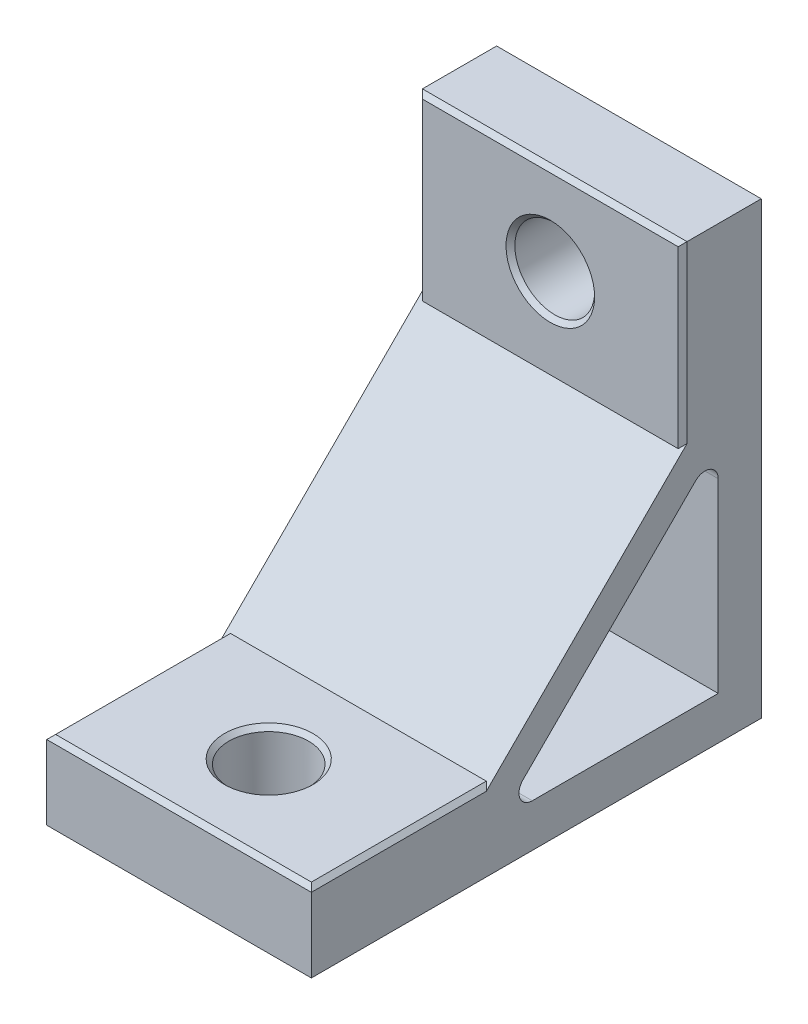
ISO-10303-21;
HEADER;
FILE_DESCRIPTION(('STEP AP214'),'2;1');
FILE_NAME('part.step','',(''),(''),'','','');
FILE_SCHEMA(('AUTOMOTIVE_DESIGN { 1 0 10303 214 1 1 1 1 }'));
ENDSEC;
DATA;
#1=APPLICATION_CONTEXT('core data for automotive mechanical design processes');
#2=APPLICATION_PROTOCOL_DEFINITION('international standard','automotive_design',2000,#1);
#3=PRODUCT_CONTEXT('',#1,'mechanical');
#4=PRODUCT('Part','Part','',(#3));
#5=PRODUCT_RELATED_PRODUCT_CATEGORY('part','',(#4));
#6=PRODUCT_DEFINITION_FORMATION('','',#4);
#7=PRODUCT_DEFINITION_CONTEXT('part definition',#1,'design');
#8=PRODUCT_DEFINITION('design','',#6,#7);
#9=PRODUCT_DEFINITION_SHAPE('','',#8);
#10=(LENGTH_UNIT() NAMED_UNIT(*) SI_UNIT(.MILLI.,.METRE.));
#11=(NAMED_UNIT(*) PLANE_ANGLE_UNIT() SI_UNIT($,.RADIAN.));
#12=(NAMED_UNIT(*) SI_UNIT($,.STERADIAN.) SOLID_ANGLE_UNIT());
#13=UNCERTAINTY_MEASURE_WITH_UNIT(LENGTH_MEASURE(1.E-05),#10,'distance_accuracy_value','');
#14=(GEOMETRIC_REPRESENTATION_CONTEXT(3) GLOBAL_UNCERTAINTY_ASSIGNED_CONTEXT((#13)) GLOBAL_UNIT_ASSIGNED_CONTEXT((#10,
#11,#12)) REPRESENTATION_CONTEXT('',''));
#15=CARTESIAN_POINT('',(0.,0.,0.));
#16=DIRECTION('',(0.,0.,1.));
#17=DIRECTION('',(1.,0.,0.));
#18=AXIS2_PLACEMENT_3D('',#15,#16,#17);
#19=CARTESIAN_POINT('',(14.94,0.,0.));
#20=DIRECTION('',(1.,0.,0.));
#21=DIRECTION('',(0.,0.,-1.));
#22=AXIS2_PLACEMENT_3D('',#19,#20,#21);
#23=PLANE('',#22);
#24=DIRECTION('',(0.,-0.707106781186552,0.707106781186543));
#25=VECTOR('',#24,1.);
#26=CARTESIAN_POINT('',(14.94,21.67,0.));
#27=LINE('',#26,#25);
#28=CARTESIAN_POINT('',(14.94,22.17,-0.499999999999994));
#29=VERTEX_POINT('',#28);
#30=CARTESIAN_POINT('',(14.94,-0.500000000000004,22.1699999999997));
#31=VERTEX_POINT('',#30);
#32=EDGE_CURVE('E195',#29,#31,#27,.T.);
#33=ORIENTED_EDGE('',*,*,#32,.T.);
#34=DIRECTION('',(0.,0.,1.));
#35=VECTOR('',#34,1.);
#36=CARTESIAN_POINT('',(14.94,-0.5,41.92));
#37=LINE('',#36,#35);
#38=CARTESIAN_POINT('',(14.94,-0.5,41.92));
#39=VERTEX_POINT('',#38);
#40=EDGE_CURVE('E249',#31,#39,#37,.T.);
#41=ORIENTED_EDGE('',*,*,#40,.T.);
#42=DIRECTION('',(0.,-1.,0.));
#43=VECTOR('',#42,1.);
#44=CARTESIAN_POINT('',(14.94,0.,41.92));
#45=LINE('',#44,#43);
#46=CARTESIAN_POINT('',(14.94,-8.88000000000001,41.92));
#47=VERTEX_POINT('',#46);
#48=EDGE_CURVE('E185',#39,#47,#45,.T.);
#49=ORIENTED_EDGE('',*,*,#48,.T.);
#50=DIRECTION('',(0.,0.,-1.));
#51=VECTOR('',#50,1.);
#52=CARTESIAN_POINT('',(14.94,-8.88000000000001,41.92));
#53=LINE('',#52,#51);
#54=CARTESIAN_POINT('',(14.94,-8.88,-8.88));
#55=VERTEX_POINT('',#54);
#56=EDGE_CURVE('E187',#47,#55,#53,.T.);
#57=ORIENTED_EDGE('',*,*,#56,.T.);
#58=DIRECTION('',(0.,1.,0.));
#59=VECTOR('',#58,1.);
#60=CARTESIAN_POINT('',(14.94,-8.88,-8.88));
#61=LINE('',#60,#59);
#62=CARTESIAN_POINT('',(14.94,41.92,-8.88));
#63=VERTEX_POINT('',#62);
#64=EDGE_CURVE('E190',#55,#63,#61,.T.);
#65=ORIENTED_EDGE('',*,*,#64,.T.);
#66=DIRECTION('',(0.,0.,1.));
#67=VECTOR('',#66,1.);
#68=CARTESIAN_POINT('',(14.94,41.92,-8.88));
#69=LINE('',#68,#67);
#70=CARTESIAN_POINT('',(14.94,41.92,-0.499999999999994));
#71=VERTEX_POINT('',#70);
#72=EDGE_CURVE('E192',#63,#71,#69,.T.);
#73=ORIENTED_EDGE('',*,*,#72,.T.);
#74=DIRECTION('',(0.,-1.,0.));
#75=VECTOR('',#74,1.);
#76=CARTESIAN_POINT('',(14.94,21.67,-0.499999999999993));
#77=LINE('',#76,#75);
#78=EDGE_CURVE('E246',#71,#29,#77,.T.);
#79=ORIENTED_EDGE('',*,*,#78,.T.);
#80=EDGE_LOOP('',(#33,#41,#49,#57,#65,#73,#79));
#81=FACE_BOUND('',#80,.T.);
#82=DIRECTION('',(0.,0.,-1.));
#83=VECTOR('',#82,1.);
#84=CARTESIAN_POINT('',(14.94,-4.01999999999994,0.));
#85=LINE('',#84,#83);
#86=CARTESIAN_POINT('',(14.94,-4.01999999999984,16.9775108318969));
#87=VERTEX_POINT('',#86);
#88=CARTESIAN_POINT('',(14.94,-4.01999999999997,-4.02));
#89=VERTEX_POINT('',#88);
#90=EDGE_CURVE('E155',#87,#89,#85,.T.);
#91=ORIENTED_EDGE('',*,*,#90,.F.);
#92=CARTESIAN_POINT('',(14.94,-2.51999999999984,16.9775108318968));
#93=DIRECTION('',(1.,0.,0.));
#94=DIRECTION('',(0.,0.,-1.));
#95=AXIS2_PLACEMENT_3D('',#92,#93,#94);
#96=CIRCLE('',#95,1.5);
#97=CARTESIAN_POINT('',(14.94,-1.45933982822002,18.0381710036767));
#98=VERTEX_POINT('',#97);
#99=EDGE_CURVE('E227',#87,#98,#96,.F.);
#100=ORIENTED_EDGE('',*,*,#99,.T.);
#101=DIRECTION('',(0.,0.707106781186545,-0.70710678118655));
#102=VECTOR('',#101,1.);
#103=CARTESIAN_POINT('',(14.94,8.28941558772832,8.28941558772827));
#104=LINE('',#103,#102);
#105=CARTESIAN_POINT('',(14.94,18.0381710036767,-1.45933982822018));
#106=VERTEX_POINT('',#105);
#107=EDGE_CURVE('E171',#98,#106,#104,.T.);
#108=ORIENTED_EDGE('',*,*,#107,.T.);
#109=CARTESIAN_POINT('',(14.94,16.9775108318969,-2.52));
#110=DIRECTION('',(1.,0.,0.));
#111=DIRECTION('',(0.,0.,-1.));
#112=AXIS2_PLACEMENT_3D('',#109,#110,#111);
#113=CIRCLE('',#112,1.5);
#114=CARTESIAN_POINT('',(14.94,16.9775108318969,-4.02));
#115=VERTEX_POINT('',#114);
#116=EDGE_CURVE('E157',#106,#115,#113,.F.);
#117=ORIENTED_EDGE('',*,*,#116,.T.);
#118=DIRECTION('',(0.,-1.,0.));
#119=VECTOR('',#118,1.);
#120=CARTESIAN_POINT('',(14.94,0.,-4.02));
#121=LINE('',#120,#119);
#122=EDGE_CURVE('E153',#115,#89,#121,.T.);
#123=ORIENTED_EDGE('',*,*,#122,.T.);
#124=EDGE_LOOP('',(#91,#100,#108,#117,#123));
#125=FACE_BOUND('',#124,.T.);
#126=ADVANCED_FACE('F37',(#81,#125),#23,.T.);
#127=CARTESIAN_POINT('',(-14.94,0.,0.));
#128=DIRECTION('',(1.,0.,0.));
#129=DIRECTION('',(0.,0.,-1.));
#130=AXIS2_PLACEMENT_3D('',#127,#128,#129);
#131=PLANE('',#130);
#132=DIRECTION('',(0.,-1.,0.));
#133=VECTOR('',#132,1.);
#134=CARTESIAN_POINT('',(-14.94,0.,41.92));
#135=LINE('',#134,#133);
#136=CARTESIAN_POINT('',(-14.94,-0.5,41.92));
#137=VERTEX_POINT('',#136);
#138=CARTESIAN_POINT('',(-14.94,-8.88000000000001,41.92));
#139=VERTEX_POINT('',#138);
#140=EDGE_CURVE('E177',#137,#139,#135,.T.);
#141=ORIENTED_EDGE('',*,*,#140,.F.);
#142=DIRECTION('',(0.,0.,-1.));
#143=VECTOR('',#142,1.);
#144=CARTESIAN_POINT('',(-14.94,-0.500000000000007,0.));
#145=LINE('',#144,#143);
#146=CARTESIAN_POINT('',(-14.94,-0.500000000000004,22.1699999999997));
#147=VERTEX_POINT('',#146);
#148=EDGE_CURVE('E256',#137,#147,#145,.T.);
#149=ORIENTED_EDGE('',*,*,#148,.T.);
#150=DIRECTION('',(0.,-0.707106781186552,0.707106781186543));
#151=VECTOR('',#150,1.);
#152=CARTESIAN_POINT('',(-14.94,21.67,0.));
#153=LINE('',#152,#151);
#154=CARTESIAN_POINT('',(-14.94,22.17,-0.499999999999993));
#155=VERTEX_POINT('',#154);
#156=EDGE_CURVE('E188',#155,#147,#153,.T.);
#157=ORIENTED_EDGE('',*,*,#156,.F.);
#158=DIRECTION('',(0.,1.,0.));
#159=VECTOR('',#158,1.);
#160=CARTESIAN_POINT('',(-14.94,0.,-0.499999999999993));
#161=LINE('',#160,#159);
#162=CARTESIAN_POINT('',(-14.94,41.92,-0.499999999999995));
#163=VERTEX_POINT('',#162);
#164=EDGE_CURVE('E254',#155,#163,#161,.T.);
#165=ORIENTED_EDGE('',*,*,#164,.T.);
#166=DIRECTION('',(0.,0.,1.));
#167=VECTOR('',#166,1.);
#168=CARTESIAN_POINT('',(-14.94,41.92,-8.88));
#169=LINE('',#168,#167);
#170=CARTESIAN_POINT('',(-14.94,41.92,-8.88));
#171=VERTEX_POINT('',#170);
#172=EDGE_CURVE('E201',#171,#163,#169,.T.);
#173=ORIENTED_EDGE('',*,*,#172,.F.);
#174=DIRECTION('',(0.,1.,0.));
#175=VECTOR('',#174,1.);
#176=CARTESIAN_POINT('',(-14.94,-8.88,-8.88));
#177=LINE('',#176,#175);
#178=CARTESIAN_POINT('',(-14.94,-8.88,-8.88));
#179=VERTEX_POINT('',#178);
#180=EDGE_CURVE('E199',#179,#171,#177,.T.);
#181=ORIENTED_EDGE('',*,*,#180,.F.);
#182=DIRECTION('',(0.,0.,-1.));
#183=VECTOR('',#182,1.);
#184=CARTESIAN_POINT('',(-14.94,-8.88000000000001,41.92));
#185=LINE('',#184,#183);
#186=EDGE_CURVE('E179',#139,#179,#185,.T.);
#187=ORIENTED_EDGE('',*,*,#186,.F.);
#188=EDGE_LOOP('',(#141,#149,#157,#165,#173,#181,#187));
#189=FACE_BOUND('',#188,.T.);
#190=DIRECTION('',(0.,0.707106781186545,-0.70710678118655));
#191=VECTOR('',#190,1.);
#192=CARTESIAN_POINT('',(-14.94,8.28941558772832,8.28941558772827));
#193=LINE('',#192,#191);
#194=CARTESIAN_POINT('',(-14.94,-1.45933982822002,18.0381710036767));
#195=VERTEX_POINT('',#194);
#196=CARTESIAN_POINT('',(-14.94,18.0381710036767,-1.45933982822018));
#197=VERTEX_POINT('',#196);
#198=EDGE_CURVE('E161',#195,#197,#193,.T.);
#199=ORIENTED_EDGE('',*,*,#198,.F.);
#200=CARTESIAN_POINT('',(-14.94,-2.51999999999984,16.9775108318968));
#201=DIRECTION('',(1.,0.,0.));
#202=DIRECTION('',(0.,0.,-1.));
#203=AXIS2_PLACEMENT_3D('',#200,#201,#202);
#204=CIRCLE('',#203,1.5);
#205=CARTESIAN_POINT('',(-14.94,-4.01999999999984,16.9775108318969));
#206=VERTEX_POINT('',#205);
#207=EDGE_CURVE('E229',#195,#206,#204,.T.);
#208=ORIENTED_EDGE('',*,*,#207,.T.);
#209=DIRECTION('',(0.,0.,-1.));
#210=VECTOR('',#209,1.);
#211=CARTESIAN_POINT('',(-14.94,-4.01999999999994,0.));
#212=LINE('',#211,#210);
#213=CARTESIAN_POINT('',(-14.94,-4.01999999999997,-4.02));
#214=VERTEX_POINT('',#213);
#215=EDGE_CURVE('E181',#206,#214,#212,.T.);
#216=ORIENTED_EDGE('',*,*,#215,.T.);
#217=DIRECTION('',(0.,-1.,0.));
#218=VECTOR('',#217,1.);
#219=CARTESIAN_POINT('',(-14.94,0.,-4.02));
#220=LINE('',#219,#218);
#221=CARTESIAN_POINT('',(-14.94,16.9775108318969,-4.02));
#222=VERTEX_POINT('',#221);
#223=EDGE_CURVE('E175',#222,#214,#220,.T.);
#224=ORIENTED_EDGE('',*,*,#223,.F.);
#225=CARTESIAN_POINT('',(-14.94,16.9775108318969,-2.52));
#226=DIRECTION('',(1.,0.,0.));
#227=DIRECTION('',(0.,0.,-1.));
#228=AXIS2_PLACEMENT_3D('',#225,#226,#227);
#229=CIRCLE('',#228,1.5);
#230=EDGE_CURVE('E232',#222,#197,#229,.T.);
#231=ORIENTED_EDGE('',*,*,#230,.T.);
#232=EDGE_LOOP('',(#199,#208,#216,#224,#231));
#233=FACE_BOUND('',#232,.T.);
#234=ADVANCED_FACE('F305',(#189,#233),#131,.F.);
#235=CARTESIAN_POINT('',(14.94,0.,41.92));
#236=DIRECTION('',(0.,0.,-1.));
#237=DIRECTION('',(-1.,0.,0.));
#238=AXIS2_PLACEMENT_3D('',#235,#236,#237);
#239=PLANE('',#238);
#240=ORIENTED_EDGE('',*,*,#48,.F.);
#241=DIRECTION('',(-1.,0.,0.));
#242=VECTOR('',#241,1.);
#243=CARTESIAN_POINT('',(14.94,-0.5,41.92));
#244=LINE('',#243,#242);
#245=EDGE_CURVE('E252',#39,#137,#244,.T.);
#246=ORIENTED_EDGE('',*,*,#245,.T.);
#247=ORIENTED_EDGE('',*,*,#140,.T.);
#248=DIRECTION('',(-1.,0.,0.));
#249=VECTOR('',#248,1.);
#250=CARTESIAN_POINT('',(14.94,-8.88000000000001,41.92));
#251=LINE('',#250,#249);
#252=EDGE_CURVE('E216',#47,#139,#251,.T.);
#253=ORIENTED_EDGE('',*,*,#252,.F.);
#254=EDGE_LOOP('',(#240,#246,#247,#253));
#255=FACE_BOUND('',#254,.T.);
#256=ADVANCED_FACE('F324',(#255),#239,.F.);
#257=CARTESIAN_POINT('',(14.94,-8.88000000000001,41.92));
#258=DIRECTION('',(0.,1.,0.));
#259=DIRECTION('',(0.,0.,1.));
#260=AXIS2_PLACEMENT_3D('',#257,#258,#259);
#261=PLANE('',#260);
#262=CARTESIAN_POINT('',(0.,-8.88000000000001,31.7949999999999));
#263=DIRECTION('',(0.,1.,0.));
#264=DIRECTION('',(0.,0.,1.));
#265=AXIS2_PLACEMENT_3D('',#262,#263,#264);
#266=CIRCLE('',#265,4.5);
#267=CARTESIAN_POINT('',(0.,-8.88000000000001,36.2949999999999));
#268=VERTEX_POINT('',#267);
#269=EDGE_CURVE('E376',#268,#268,#266,.T.);
#270=ORIENTED_EDGE('',*,*,#269,.T.);
#271=EDGE_LOOP('',(#270));
#272=FACE_BOUND('',#271,.T.);
#273=ORIENTED_EDGE('',*,*,#186,.T.);
#274=DIRECTION('',(-1.,0.,0.));
#275=VECTOR('',#274,1.);
#276=CARTESIAN_POINT('',(14.94,-8.88,-8.88));
#277=LINE('',#276,#275);
#278=EDGE_CURVE('E213',#55,#179,#277,.T.);
#279=ORIENTED_EDGE('',*,*,#278,.F.);
#280=ORIENTED_EDGE('',*,*,#56,.F.);
#281=ORIENTED_EDGE('',*,*,#252,.T.);
#282=EDGE_LOOP('',(#273,#279,#280,#281));
#283=FACE_BOUND('',#282,.T.);
#284=ADVANCED_FACE('F326',(#272,#283),#261,.F.);
#285=CARTESIAN_POINT('',(14.94,-8.88,-8.88));
#286=DIRECTION('',(0.,0.,1.));
#287=DIRECTION('',(1.,0.,0.));
#288=AXIS2_PLACEMENT_3D('',#285,#286,#287);
#289=PLANE('',#288);
#290=CARTESIAN_POINT('',(0.,31.795,-8.88));
#291=DIRECTION('',(0.,0.,1.));
#292=DIRECTION('',(1.,0.,0.));
#293=AXIS2_PLACEMENT_3D('',#290,#291,#292);
#294=CIRCLE('',#293,4.5);
#295=CARTESIAN_POINT('',(4.5,31.795,-8.88));
#296=VERTEX_POINT('',#295);
#297=EDGE_CURVE('E282',#296,#296,#294,.T.);
#298=ORIENTED_EDGE('',*,*,#297,.T.);
#299=EDGE_LOOP('',(#298));
#300=FACE_BOUND('',#299,.T.);
#301=ORIENTED_EDGE('',*,*,#180,.T.);
#302=DIRECTION('',(-1.,0.,0.));
#303=VECTOR('',#302,1.);
#304=CARTESIAN_POINT('',(14.94,41.92,-8.88));
#305=LINE('',#304,#303);
#306=EDGE_CURVE('E210',#63,#171,#305,.T.);
#307=ORIENTED_EDGE('',*,*,#306,.F.);
#308=ORIENTED_EDGE('',*,*,#64,.F.);
#309=ORIENTED_EDGE('',*,*,#278,.T.);
#310=EDGE_LOOP('',(#301,#307,#308,#309));
#311=FACE_BOUND('',#310,.T.);
#312=ADVANCED_FACE('F329',(#300,#311),#289,.F.);
#313=CARTESIAN_POINT('',(14.94,41.92,-8.88));
#314=DIRECTION('',(0.,-1.,0.));
#315=DIRECTION('',(0.,0.,-1.));
#316=AXIS2_PLACEMENT_3D('',#313,#314,#315);
#317=PLANE('',#316);
#318=ORIENTED_EDGE('',*,*,#172,.T.);
#319=DIRECTION('',(1.,0.,0.));
#320=VECTOR('',#319,1.);
#321=CARTESIAN_POINT('',(14.94,41.92,-0.499999999999995));
#322=LINE('',#321,#320);
#323=EDGE_CURVE('E269',#163,#71,#322,.T.);
#324=ORIENTED_EDGE('',*,*,#323,.T.);
#325=ORIENTED_EDGE('',*,*,#72,.F.);
#326=ORIENTED_EDGE('',*,*,#306,.T.);
#327=EDGE_LOOP('',(#318,#324,#325,#326));
#328=FACE_BOUND('',#327,.T.);
#329=ADVANCED_FACE('F300',(#328),#317,.F.);
#330=CARTESIAN_POINT('',(14.94,41.92,0.));
#331=DIRECTION('',(0.,0.,-1.));
#332=DIRECTION('',(0.,1.,0.));
#333=AXIS2_PLACEMENT_3D('',#330,#331,#332);
#334=PLANE('',#333);
#335=CARTESIAN_POINT('',(0.,31.795,0.));
#336=DIRECTION('',(0.,0.,-1.));
#337=DIRECTION('',(0.,1.,0.));
#338=AXIS2_PLACEMENT_3D('',#335,#336,#337);
#339=CIRCLE('',#338,4.99999999999999);
#340=CARTESIAN_POINT('',(0.,36.795,0.));
#341=VERTEX_POINT('',#340);
#342=EDGE_CURVE('E266',#341,#341,#339,.T.);
#343=ORIENTED_EDGE('',*,*,#342,.T.);
#344=EDGE_LOOP('',(#343));
#345=FACE_BOUND('',#344,.T.);
#346=DIRECTION('',(-1.,0.,0.));
#347=VECTOR('',#346,1.);
#348=CARTESIAN_POINT('',(14.94,41.42,0.));
#349=LINE('',#348,#347);
#350=CARTESIAN_POINT('',(14.44,41.42,0.));
#351=VERTEX_POINT('',#350);
#352=CARTESIAN_POINT('',(-14.44,41.42,0.));
#353=VERTEX_POINT('',#352);
#354=EDGE_CURVE('E55',#351,#353,#349,.T.);
#355=ORIENTED_EDGE('',*,*,#354,.T.);
#356=DIRECTION('',(0.,-1.,0.));
#357=VECTOR('',#356,1.);
#358=CARTESIAN_POINT('',(-14.44,41.92,0.));
#359=LINE('',#358,#357);
#360=CARTESIAN_POINT('',(-14.44,21.67,0.));
#361=VERTEX_POINT('',#360);
#362=EDGE_CURVE('E264',#353,#361,#359,.T.);
#363=ORIENTED_EDGE('',*,*,#362,.T.);
#364=DIRECTION('',(-1.,0.,0.));
#365=VECTOR('',#364,1.);
#366=CARTESIAN_POINT('',(14.94,21.67,0.));
#367=LINE('',#366,#365);
#368=CARTESIAN_POINT('',(14.44,21.67,0.));
#369=VERTEX_POINT('',#368);
#370=EDGE_CURVE('E207',#369,#361,#367,.T.);
#371=ORIENTED_EDGE('',*,*,#370,.F.);
#372=DIRECTION('',(0.,1.,0.));
#373=VECTOR('',#372,1.);
#374=CARTESIAN_POINT('',(14.44,41.92,0.));
#375=LINE('',#374,#373);
#376=EDGE_CURVE('E60',#369,#351,#375,.T.);
#377=ORIENTED_EDGE('',*,*,#376,.T.);
#378=EDGE_LOOP('',(#355,#363,#371,#377));
#379=FACE_BOUND('',#378,.T.);
#380=ADVANCED_FACE('F310',(#345,#379),#334,.F.);
#381=CARTESIAN_POINT('',(14.94,21.67,0.));
#382=DIRECTION('',(0.,-0.707106781186543,-0.707106781186552));
#383=DIRECTION('',(0.,0.707106781186552,-0.707106781186543));
#384=AXIS2_PLACEMENT_3D('',#381,#382,#383);
#385=PLANE('',#384);
#386=ORIENTED_EDGE('',*,*,#156,.T.);
#387=DIRECTION('',(-0.577350269189623,-0.577350269189631,0.577350269189624));
#388=VECTOR('',#387,1.);
#389=CARTESIAN_POINT('',(9.79999999999978,24.2400000000001,-2.57000000000008));
#390=LINE('',#389,#388);
#391=CARTESIAN_POINT('',(-14.44,0.,21.6699999999997));
#392=VERTEX_POINT('',#391);
#393=EDGE_CURVE('E274',#147,#392,#390,.F.);
#394=ORIENTED_EDGE('',*,*,#393,.T.);
#395=DIRECTION('',(-1.,0.,0.));
#396=VECTOR('',#395,1.);
#397=CARTESIAN_POINT('',(14.94,0.,21.6699999999997));
#398=LINE('',#397,#396);
#399=CARTESIAN_POINT('',(14.44,0.,21.6699999999997));
#400=VERTEX_POINT('',#399);
#401=EDGE_CURVE('E196',#400,#392,#398,.T.);
#402=ORIENTED_EDGE('',*,*,#401,.F.);
#403=DIRECTION('',(0.577350269189623,-0.577350269189631,0.577350269189624));
#404=VECTOR('',#403,1.);
#405=CARTESIAN_POINT('',(0.16000000000012,14.2800000000001,7.38999999999984));
#406=LINE('',#405,#404);
#407=EDGE_CURVE('E271',#400,#31,#406,.T.);
#408=ORIENTED_EDGE('',*,*,#407,.T.);
#409=ORIENTED_EDGE('',*,*,#32,.F.);
#410=DIRECTION('',(-0.577350269189629,-0.577350269189627,0.577350269189621));
#411=VECTOR('',#410,1.);
#412=CARTESIAN_POINT('',(14.6066666666667,21.8366666666667,-0.166666666666666));
#413=LINE('',#412,#411);
#414=EDGE_CURVE('E11',#29,#369,#413,.T.);
#415=ORIENTED_EDGE('',*,*,#414,.T.);
#416=ORIENTED_EDGE('',*,*,#370,.T.);
#417=DIRECTION('',(0.577350269189629,-0.577350269189627,0.577350269189621));
#418=VECTOR('',#417,1.);
#419=CARTESIAN_POINT('',(-4.64666666666655,11.8766666666666,9.7933333333333));
#420=LINE('',#419,#418);
#421=EDGE_CURVE('E47',#361,#155,#420,.F.);
#422=ORIENTED_EDGE('',*,*,#421,.T.);
#423=EDGE_LOOP('',(#386,#394,#402,#408,#409,#415,#416,#422));
#424=FACE_BOUND('',#423,.T.);
#425=ADVANCED_FACE('F311',(#424),#385,.F.);
#426=CARTESIAN_POINT('',(14.94,0.,21.6699999999997));
#427=DIRECTION('',(0.,-1.,0.));
#428=DIRECTION('',(0.,0.,-1.));
#429=AXIS2_PLACEMENT_3D('',#426,#427,#428);
#430=PLANE('',#429);
#431=CARTESIAN_POINT('',(0.,0.,31.7949999999999));
#432=DIRECTION('',(0.,-1.,0.));
#433=DIRECTION('',(0.,0.,-1.));
#434=AXIS2_PLACEMENT_3D('',#431,#432,#433);
#435=CIRCLE('',#434,4.99999999999999);
#436=CARTESIAN_POINT('',(0.,0.,26.7949999999999));
#437=VERTEX_POINT('',#436);
#438=EDGE_CURVE('E243',#437,#437,#435,.T.);
#439=ORIENTED_EDGE('',*,*,#438,.T.);
#440=EDGE_LOOP('',(#439));
#441=FACE_BOUND('',#440,.T.);
#442=DIRECTION('',(1.,0.,0.));
#443=VECTOR('',#442,1.);
#444=CARTESIAN_POINT('',(14.94,0.,41.42));
#445=LINE('',#444,#443);
#446=CARTESIAN_POINT('',(-14.44,0.,41.42));
#447=VERTEX_POINT('',#446);
#448=CARTESIAN_POINT('',(14.44,0.,41.42));
#449=VERTEX_POINT('',#448);
#450=EDGE_CURVE('E239',#447,#449,#445,.T.);
#451=ORIENTED_EDGE('',*,*,#450,.T.);
#452=DIRECTION('',(0.,0.,-1.));
#453=VECTOR('',#452,1.);
#454=CARTESIAN_POINT('',(14.44,0.,21.6699999999997));
#455=LINE('',#454,#453);
#456=EDGE_CURVE('E241',#449,#400,#455,.T.);
#457=ORIENTED_EDGE('',*,*,#456,.T.);
#458=ORIENTED_EDGE('',*,*,#401,.T.);
#459=DIRECTION('',(0.,0.,1.));
#460=VECTOR('',#459,1.);
#461=CARTESIAN_POINT('',(-14.44,0.,21.6699999999997));
#462=LINE('',#461,#460);
#463=EDGE_CURVE('E237',#392,#447,#462,.T.);
#464=ORIENTED_EDGE('',*,*,#463,.T.);
#465=EDGE_LOOP('',(#451,#457,#458,#464));
#466=FACE_BOUND('',#465,.T.);
#467=ADVANCED_FACE('F351',(#441,#466),#430,.F.);
#468=CARTESIAN_POINT('',(-14.94,8.28941558772832,8.28941558772827));
#469=DIRECTION('',(0.,-0.70710678118655,-0.707106781186545));
#470=DIRECTION('',(0.,0.707106781186545,-0.70710678118655));
#471=AXIS2_PLACEMENT_3D('',#468,#469,#470);
#472=PLANE('',#471);
#473=ORIENTED_EDGE('',*,*,#107,.F.);
#474=DIRECTION('',(1.,0.,0.));
#475=VECTOR('',#474,1.);
#476=CARTESIAN_POINT('',(-14.94,-1.45933982822002,18.0381710036767));
#477=LINE('',#476,#475);
#478=EDGE_CURVE('E223',#98,#195,#477,.F.);
#479=ORIENTED_EDGE('',*,*,#478,.T.);
#480=ORIENTED_EDGE('',*,*,#198,.T.);
#481=DIRECTION('',(1.,0.,0.));
#482=VECTOR('',#481,1.);
#483=CARTESIAN_POINT('',(14.94,18.0381710036767,-1.45933982822018));
#484=LINE('',#483,#482);
#485=EDGE_CURVE('E220',#197,#106,#484,.T.);
#486=ORIENTED_EDGE('',*,*,#485,.T.);
#487=EDGE_LOOP('',(#473,#479,#480,#486));
#488=FACE_BOUND('',#487,.T.);
#489=ADVANCED_FACE('F348',(#488),#472,.T.);
#490=CARTESIAN_POINT('',(-14.94,0.,-4.02));
#491=DIRECTION('',(0.,0.,1.));
#492=DIRECTION('',(0.,-1.,0.));
#493=AXIS2_PLACEMENT_3D('',#490,#491,#492);
#494=PLANE('',#493);
#495=ORIENTED_EDGE('',*,*,#122,.F.);
#496=DIRECTION('',(1.,0.,0.));
#497=VECTOR('',#496,1.);
#498=CARTESIAN_POINT('',(-14.94,16.9775108318969,-4.02));
#499=LINE('',#498,#497);
#500=EDGE_CURVE('E225',#115,#222,#499,.F.);
#501=ORIENTED_EDGE('',*,*,#500,.T.);
#502=ORIENTED_EDGE('',*,*,#223,.T.);
#503=DIRECTION('',(1.,0.,0.));
#504=VECTOR('',#503,1.);
#505=CARTESIAN_POINT('',(-14.94,-4.01999999999997,-4.02));
#506=LINE('',#505,#504);
#507=EDGE_CURVE('E168',#214,#89,#506,.T.);
#508=ORIENTED_EDGE('',*,*,#507,.T.);
#509=EDGE_LOOP('',(#495,#501,#502,#508));
#510=FACE_BOUND('',#509,.T.);
#511=ADVANCED_FACE('F173',(#510),#494,.T.);
#512=CARTESIAN_POINT('',(-14.94,-4.01999999999994,0.));
#513=DIRECTION('',(0.,-1.,0.));
#514=DIRECTION('',(0.,0.,-1.));
#515=AXIS2_PLACEMENT_3D('',#512,#513,#514);
#516=PLANE('',#515);
#517=ORIENTED_EDGE('',*,*,#215,.F.);
#518=DIRECTION('',(1.,0.,0.));
#519=VECTOR('',#518,1.);
#520=CARTESIAN_POINT('',(-14.94,-4.01999999999984,16.9775108318969));
#521=LINE('',#520,#519);
#522=EDGE_CURVE('E170',#206,#87,#521,.T.);
#523=ORIENTED_EDGE('',*,*,#522,.T.);
#524=ORIENTED_EDGE('',*,*,#90,.T.);
#525=ORIENTED_EDGE('',*,*,#507,.F.);
#526=EDGE_LOOP('',(#517,#523,#524,#525));
#527=FACE_BOUND('',#526,.T.);
#528=ADVANCED_FACE('F167',(#527),#516,.F.);
#529=CARTESIAN_POINT('',(-14.94,-2.51999999999984,16.9775108318968));
#530=DIRECTION('',(1.,0.,0.));
#531=DIRECTION('',(0.,0.,-1.));
#532=AXIS2_PLACEMENT_3D('',#529,#530,#531);
#533=CYLINDRICAL_SURFACE('',#532,1.5);
#534=ORIENTED_EDGE('',*,*,#207,.F.);
#535=ORIENTED_EDGE('',*,*,#478,.F.);
#536=ORIENTED_EDGE('',*,*,#99,.F.);
#537=ORIENTED_EDGE('',*,*,#522,.F.);
#538=EDGE_LOOP('',(#534,#535,#536,#537));
#539=FACE_BOUND('',#538,.T.);
#540=ADVANCED_FACE('F387',(#539),#533,.F.);
#541=CARTESIAN_POINT('',(-14.94,16.9775108318969,-2.52));
#542=DIRECTION('',(-1.,0.,0.));
#543=DIRECTION('',(0.,0.,1.));
#544=AXIS2_PLACEMENT_3D('',#541,#542,#543);
#545=CYLINDRICAL_SURFACE('',#544,1.5);
#546=ORIENTED_EDGE('',*,*,#230,.F.);
#547=ORIENTED_EDGE('',*,*,#500,.F.);
#548=ORIENTED_EDGE('',*,*,#116,.F.);
#549=ORIENTED_EDGE('',*,*,#485,.F.);
#550=EDGE_LOOP('',(#546,#547,#548,#549));
#551=FACE_BOUND('',#550,.T.);
#552=ADVANCED_FACE('F393',(#551),#545,.F.);
#553=CARTESIAN_POINT('',(0.,0.,31.7949999999999));
#554=DIRECTION('',(0.,1.,0.));
#555=DIRECTION('',(0.,0.,1.));
#556=AXIS2_PLACEMENT_3D('',#553,#554,#555);
#557=CYLINDRICAL_SURFACE('',#556,4.49999999999999);
#558=CARTESIAN_POINT('',(0.,-0.499999999999994,31.7949999999999));
#559=DIRECTION('',(0.,-1.,0.));
#560=DIRECTION('',(0.,0.,-1.));
#561=AXIS2_PLACEMENT_3D('',#558,#559,#560);
#562=CIRCLE('',#561,4.49999999999999);
#563=CARTESIAN_POINT('',(0.,-0.499999999999994,27.2949999999999));
#564=VERTEX_POINT('',#563);
#565=EDGE_CURVE('E234',#564,#564,#562,.F.);
#566=ORIENTED_EDGE('',*,*,#565,.T.);
#567=EDGE_LOOP('',(#566));
#568=FACE_BOUND('',#567,.T.);
#569=ORIENTED_EDGE('',*,*,#269,.F.);
#570=EDGE_LOOP('',(#569));
#571=FACE_BOUND('',#570,.T.);
#572=ADVANCED_FACE('F373',(#568,#571),#557,.F.);
#573=CARTESIAN_POINT('',(0.,31.795,0.));
#574=DIRECTION('',(0.,0.,1.));
#575=DIRECTION('',(1.,0.,0.));
#576=AXIS2_PLACEMENT_3D('',#573,#574,#575);
#577=CYLINDRICAL_SURFACE('',#576,4.49999999999999);
#578=CARTESIAN_POINT('',(0.,31.795,-0.499999999999992));
#579=DIRECTION('',(0.,0.,-1.));
#580=DIRECTION('',(-1.,0.,0.));
#581=AXIS2_PLACEMENT_3D('',#578,#579,#580);
#582=CIRCLE('',#581,4.49999999999999);
#583=CARTESIAN_POINT('',(-4.49999999999999,31.795,-0.499999999999992));
#584=VERTEX_POINT('',#583);
#585=EDGE_CURVE('E259',#584,#584,#582,.F.);
#586=ORIENTED_EDGE('',*,*,#585,.T.);
#587=EDGE_LOOP('',(#586));
#588=FACE_BOUND('',#587,.T.);
#589=ORIENTED_EDGE('',*,*,#297,.F.);
#590=EDGE_LOOP('',(#589));
#591=FACE_BOUND('',#590,.T.);
#592=ADVANCED_FACE('F369',(#588,#591),#577,.F.);
#593=CARTESIAN_POINT('',(0.,-0.499999999999994,31.7949999999999));
#594=DIRECTION('',(0.,1.,0.));
#595=DIRECTION('',(0.,0.,1.));
#596=AXIS2_PLACEMENT_3D('',#593,#594,#595);
#597=CONICAL_SURFACE('',#596,4.49999999999999,0.785398163397453);
#598=ORIENTED_EDGE('',*,*,#438,.F.);
#599=EDGE_LOOP('',(#598));
#600=FACE_BOUND('',#599,.T.);
#601=ORIENTED_EDGE('',*,*,#565,.F.);
#602=EDGE_LOOP('',(#601));
#603=FACE_BOUND('',#602,.T.);
#604=ADVANCED_FACE('F372',(#600,#603),#597,.F.);
#605=CARTESIAN_POINT('',(-14.44,0.,21.6699999999997));
#606=DIRECTION('',(0.707106781186552,-0.707106781186543,0.));
#607=DIRECTION('',(0.,0.,1.));
#608=AXIS2_PLACEMENT_3D('',#605,#606,#607);
#609=PLANE('',#608);
#610=ORIENTED_EDGE('',*,*,#393,.F.);
#611=ORIENTED_EDGE('',*,*,#148,.F.);
#612=DIRECTION('',(0.577350269189621,0.577350269189628,-0.577350269189629));
#613=VECTOR('',#612,1.);
#614=CARTESIAN_POINT('',(-7.85666666666662,6.58333333333348,34.8366666666665));
#615=LINE('',#614,#613);
#616=EDGE_CURVE('E280',#447,#137,#615,.F.);
#617=ORIENTED_EDGE('',*,*,#616,.F.);
#618=ORIENTED_EDGE('',*,*,#463,.F.);
#619=EDGE_LOOP('',(#610,#611,#617,#618));
#620=FACE_BOUND('',#619,.T.);
#621=ADVANCED_FACE('F411',(#620),#609,.F.);
#622=CARTESIAN_POINT('',(14.94,-0.5,41.92));
#623=DIRECTION('',(0.,-0.707106781186548,-0.707106781186547));
#624=DIRECTION('',(-1.,0.,0.));
#625=AXIS2_PLACEMENT_3D('',#622,#623,#624);
#626=PLANE('',#625);
#627=ORIENTED_EDGE('',*,*,#616,.T.);
#628=ORIENTED_EDGE('',*,*,#245,.F.);
#629=DIRECTION('',(0.577350269189621,-0.577350269189628,0.577350269189629));
#630=VECTOR('',#629,1.);
#631=CARTESIAN_POINT('',(14.94,-0.5,41.92));
#632=LINE('',#631,#630);
#633=EDGE_CURVE('E278',#449,#39,#632,.T.);
#634=ORIENTED_EDGE('',*,*,#633,.F.);
#635=ORIENTED_EDGE('',*,*,#450,.F.);
#636=EDGE_LOOP('',(#627,#628,#634,#635));
#637=FACE_BOUND('',#636,.T.);
#638=ADVANCED_FACE('F420',(#637),#626,.F.);
#639=CARTESIAN_POINT('',(14.94,-0.500000000000007,0.));
#640=DIRECTION('',(0.707106781186552,0.707106781186543,0.));
#641=DIRECTION('',(0.,0.,-1.));
#642=AXIS2_PLACEMENT_3D('',#639,#640,#641);
#643=PLANE('',#642);
#644=ORIENTED_EDGE('',*,*,#407,.F.);
#645=ORIENTED_EDGE('',*,*,#456,.F.);
#646=ORIENTED_EDGE('',*,*,#633,.T.);
#647=ORIENTED_EDGE('',*,*,#40,.F.);
#648=EDGE_LOOP('',(#644,#645,#646,#647));
#649=FACE_BOUND('',#648,.T.);
#650=ADVANCED_FACE('F317',(#649),#643,.T.);
#651=CARTESIAN_POINT('',(0.,31.795,-0.499999999999992));
#652=DIRECTION('',(0.,0.,1.));
#653=DIRECTION('',(1.,0.,0.));
#654=AXIS2_PLACEMENT_3D('',#651,#652,#653);
#655=CONICAL_SURFACE('',#654,4.49999999999999,0.785398163397454);
#656=ORIENTED_EDGE('',*,*,#342,.F.);
#657=EDGE_LOOP('',(#656));
#658=FACE_BOUND('',#657,.T.);
#659=ORIENTED_EDGE('',*,*,#585,.F.);
#660=EDGE_LOOP('',(#659));
#661=FACE_BOUND('',#660,.T.);
#662=ADVANCED_FACE('F363',(#658,#661),#655,.F.);
#663=CARTESIAN_POINT('',(14.94,0.,-0.499999999999993));
#664=DIRECTION('',(0.707106781186542,0.,0.707106781186553));
#665=DIRECTION('',(0.,1.,0.));
#666=AXIS2_PLACEMENT_3D('',#663,#664,#665);
#667=PLANE('',#666);
#668=ORIENTED_EDGE('',*,*,#414,.F.);
#669=ORIENTED_EDGE('',*,*,#78,.F.);
#670=DIRECTION('',(0.577350269189629,0.577350269189627,-0.577350269189621));
#671=VECTOR('',#670,1.);
#672=CARTESIAN_POINT('',(0.966666666666553,27.9466666666666,13.4733333333333));
#673=LINE('',#672,#671);
#674=EDGE_CURVE('E42',#351,#71,#673,.T.);
#675=ORIENTED_EDGE('',*,*,#674,.F.);
#676=ORIENTED_EDGE('',*,*,#376,.F.);
#677=EDGE_LOOP('',(#668,#669,#675,#676));
#678=FACE_BOUND('',#677,.T.);
#679=ADVANCED_FACE('F40',(#678),#667,.T.);
#680=CARTESIAN_POINT('',(14.94,41.42,0.));
#681=DIRECTION('',(0.,-0.707106781186544,-0.707106781186551));
#682=DIRECTION('',(-1.,0.,0.));
#683=AXIS2_PLACEMENT_3D('',#680,#681,#682);
#684=PLANE('',#683);
#685=ORIENTED_EDGE('',*,*,#674,.T.);
#686=ORIENTED_EDGE('',*,*,#323,.F.);
#687=DIRECTION('',(0.577350269189629,-0.577350269189627,0.577350269189621));
#688=VECTOR('',#687,1.);
#689=CARTESIAN_POINT('',(-4.64666666666655,31.6266666666666,9.79333333333331));
#690=LINE('',#689,#688);
#691=EDGE_CURVE('E283',#353,#163,#690,.F.);
#692=ORIENTED_EDGE('',*,*,#691,.F.);
#693=ORIENTED_EDGE('',*,*,#354,.F.);
#694=EDGE_LOOP('',(#685,#686,#692,#693));
#695=FACE_BOUND('',#694,.T.);
#696=ADVANCED_FACE('F291',(#695),#684,.F.);
#697=CARTESIAN_POINT('',(-14.44,41.92,0.));
#698=DIRECTION('',(0.707106781186542,0.,-0.707106781186553));
#699=DIRECTION('',(0.,-1.,0.));
#700=AXIS2_PLACEMENT_3D('',#697,#698,#699);
#701=PLANE('',#700);
#702=ORIENTED_EDGE('',*,*,#691,.T.);
#703=ORIENTED_EDGE('',*,*,#164,.F.);
#704=ORIENTED_EDGE('',*,*,#421,.F.);
#705=ORIENTED_EDGE('',*,*,#362,.F.);
#706=EDGE_LOOP('',(#702,#703,#704,#705));
#707=FACE_BOUND('',#706,.T.);
#708=ADVANCED_FACE('F308',(#707),#701,.F.);
#709=CLOSED_SHELL('',(#126,#234,#256,#284,#312,#329,#380,#425,#467,#489,#511,#528,#540,#552,
#572,#592,#604,#621,#638,#650,#662,#679,#696,#708));
#710=MANIFOLD_SOLID_BREP('B2',#709);
#711=ADVANCED_BREP_SHAPE_REPRESENTATION('',(#18,#710),#14);
#712=SHAPE_DEFINITION_REPRESENTATION(#9,#711);
ENDSEC;
END-ISO-10303-21;
